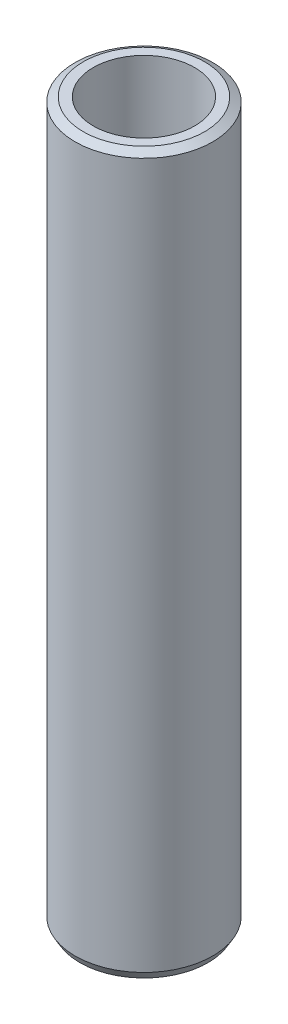
ISO-10303-21;
HEADER;
FILE_DESCRIPTION(('STEP AP214'),'2;1');
FILE_NAME('part.step','',(''),(''),'','','');
FILE_SCHEMA(('AUTOMOTIVE_DESIGN { 1 0 10303 214 1 1 1 1 }'));
ENDSEC;
DATA;
#1=APPLICATION_CONTEXT('core data for automotive mechanical design processes');
#2=APPLICATION_PROTOCOL_DEFINITION('international standard','automotive_design',2000,#1);
#3=PRODUCT_CONTEXT('',#1,'mechanical');
#4=PRODUCT('Part','Part','',(#3));
#5=PRODUCT_RELATED_PRODUCT_CATEGORY('part','',(#4));
#6=PRODUCT_DEFINITION_FORMATION('','',#4);
#7=PRODUCT_DEFINITION_CONTEXT('part definition',#1,'design');
#8=PRODUCT_DEFINITION('design','',#6,#7);
#9=PRODUCT_DEFINITION_SHAPE('','',#8);
#10=(LENGTH_UNIT() NAMED_UNIT(*) SI_UNIT(.MILLI.,.METRE.));
#11=(NAMED_UNIT(*) PLANE_ANGLE_UNIT() SI_UNIT($,.RADIAN.));
#12=(NAMED_UNIT(*) SI_UNIT($,.STERADIAN.) SOLID_ANGLE_UNIT());
#13=UNCERTAINTY_MEASURE_WITH_UNIT(LENGTH_MEASURE(1.E-05),#10,'distance_accuracy_value','');
#14=(GEOMETRIC_REPRESENTATION_CONTEXT(3) GLOBAL_UNCERTAINTY_ASSIGNED_CONTEXT((#13)) GLOBAL_UNIT_ASSIGNED_CONTEXT((#10,
#11,#12)) REPRESENTATION_CONTEXT('',''));
#15=CARTESIAN_POINT('',(0.,0.,0.));
#16=DIRECTION('',(0.,0.,1.));
#17=DIRECTION('',(1.,0.,0.));
#18=AXIS2_PLACEMENT_3D('',#15,#16,#17);
#19=CARTESIAN_POINT('',(0.,600.,0.));
#20=DIRECTION('',(0.,-1.,0.));
#21=DIRECTION('',(0.,0.,-1.));
#22=AXIS2_PLACEMENT_3D('',#19,#20,#21);
#23=CYLINDRICAL_SURFACE('',#22,57.5);
#24=CARTESIAN_POINT('',(0.,596.068807220003,0.));
#25=DIRECTION('',(0.,1.,0.));
#26=DIRECTION('',(0.,0.,1.));
#27=AXIS2_PLACEMENT_3D('',#24,#25,#26);
#28=CIRCLE('',#27,57.5);
#29=CARTESIAN_POINT('',(0.,596.068807220003,57.5));
#30=VERTEX_POINT('',#29);
#31=EDGE_CURVE('E50',#30,#30,#28,.F.);
#32=ORIENTED_EDGE('',*,*,#31,.T.);
#33=EDGE_LOOP('',(#32));
#34=FACE_BOUND('',#33,.T.);
#35=CARTESIAN_POINT('',(0.,6.80902562930219,0.));
#36=DIRECTION('',(0.,1.,0.));
#37=DIRECTION('',(0.,0.,1.));
#38=AXIS2_PLACEMENT_3D('',#35,#36,#37);
#39=CIRCLE('',#38,57.5);
#40=CARTESIAN_POINT('',(0.,6.80902562930219,57.5));
#41=VERTEX_POINT('',#40);
#42=EDGE_CURVE('E51',#41,#41,#39,.T.);
#43=ORIENTED_EDGE('',*,*,#42,.T.);
#44=EDGE_LOOP('',(#43));
#45=FACE_BOUND('',#44,.T.);
#46=ADVANCED_FACE('F39',(#34,#45),#23,.T.);
#47=CARTESIAN_POINT('',(0.,600.,0.));
#48=DIRECTION('',(0.,1.,0.));
#49=DIRECTION('',(0.,0.,1.));
#50=AXIS2_PLACEMENT_3D('',#47,#48,#49);
#51=PLANE('',#50);
#52=CARTESIAN_POINT('',(0.,600.,0.));
#53=DIRECTION('',(0.,1.,0.));
#54=DIRECTION('',(0.,0.,1.));
#55=AXIS2_PLACEMENT_3D('',#52,#53,#54);
#56=CIRCLE('',#55,50.6909743706976);
#57=CARTESIAN_POINT('',(0.,600.,50.6909743706976));
#58=VERTEX_POINT('',#57);
#59=EDGE_CURVE('E54',#58,#58,#56,.T.);
#60=ORIENTED_EDGE('',*,*,#59,.T.);
#61=EDGE_LOOP('',(#60));
#62=FACE_BOUND('',#61,.T.);
#63=CARTESIAN_POINT('',(0.,600.,0.));
#64=DIRECTION('',(0.,1.,0.));
#65=DIRECTION('',(0.,0.,1.));
#66=AXIS2_PLACEMENT_3D('',#63,#64,#65);
#67=CIRCLE('',#66,42.3572598121531);
#68=CARTESIAN_POINT('',(0.,600.,42.3572598121531));
#69=VERTEX_POINT('',#68);
#70=EDGE_CURVE('E58',#69,#69,#67,.T.);
#71=ORIENTED_EDGE('',*,*,#70,.F.);
#72=EDGE_LOOP('',(#71));
#73=FACE_BOUND('',#72,.T.);
#74=ADVANCED_FACE('F69',(#62,#73),#51,.T.);
#75=CARTESIAN_POINT('',(0.,0.,0.));
#76=DIRECTION('',(0.,1.,0.));
#77=DIRECTION('',(0.,0.,1.));
#78=AXIS2_PLACEMENT_3D('',#75,#76,#77);
#79=PLANE('',#78);
#80=CARTESIAN_POINT('',(0.,0.,0.));
#81=DIRECTION('',(0.,1.,0.));
#82=DIRECTION('',(0.,0.,1.));
#83=AXIS2_PLACEMENT_3D('',#80,#81,#82);
#84=CIRCLE('',#83,53.5688072200033);
#85=CARTESIAN_POINT('',(0.,0.,53.5688072200033));
#86=VERTEX_POINT('',#85);
#87=EDGE_CURVE('E10',#86,#86,#84,.F.);
#88=ORIENTED_EDGE('',*,*,#87,.T.);
#89=EDGE_LOOP('',(#88));
#90=FACE_BOUND('',#89,.T.);
#91=CARTESIAN_POINT('',(0.,0.,0.));
#92=DIRECTION('',(0.,1.,0.));
#93=DIRECTION('',(0.,0.,1.));
#94=AXIS2_PLACEMENT_3D('',#91,#92,#93);
#95=CIRCLE('',#94,42.3572598121531);
#96=CARTESIAN_POINT('',(0.,0.,42.3572598121531));
#97=VERTEX_POINT('',#96);
#98=EDGE_CURVE('E63',#97,#97,#95,.T.);
#99=ORIENTED_EDGE('',*,*,#98,.T.);
#100=EDGE_LOOP('',(#99));
#101=FACE_BOUND('',#100,.T.);
#102=ADVANCED_FACE('F75',(#90,#101),#79,.F.);
#103=CARTESIAN_POINT('',(0.,600.,0.));
#104=DIRECTION('',(0.,-1.,0.));
#105=DIRECTION('',(0.,0.,-1.));
#106=AXIS2_PLACEMENT_3D('',#103,#104,#105);
#107=CYLINDRICAL_SURFACE('',#106,42.3572598121531);
#108=ORIENTED_EDGE('',*,*,#70,.T.);
#109=EDGE_LOOP('',(#108));
#110=FACE_BOUND('',#109,.T.);
#111=ORIENTED_EDGE('',*,*,#98,.F.);
#112=EDGE_LOOP('',(#111));
#113=FACE_BOUND('',#112,.T.);
#114=ADVANCED_FACE('F70',(#110,#113),#107,.F.);
#115=CARTESIAN_POINT('',(0.,600.,0.));
#116=DIRECTION('',(0.,-1.,0.));
#117=DIRECTION('',(0.,0.,-1.));
#118=AXIS2_PLACEMENT_3D('',#115,#116,#117);
#119=CONICAL_SURFACE('',#118,50.6909743706976,1.04719755119659);
#120=ORIENTED_EDGE('',*,*,#31,.F.);
#121=EDGE_LOOP('',(#120));
#122=FACE_BOUND('',#121,.T.);
#123=ORIENTED_EDGE('',*,*,#59,.F.);
#124=EDGE_LOOP('',(#123));
#125=FACE_BOUND('',#124,.T.);
#126=ADVANCED_FACE('F81',(#122,#125),#119,.T.);
#127=CARTESIAN_POINT('',(0.,6.80902562930219,0.));
#128=DIRECTION('',(0.,1.,0.));
#129=DIRECTION('',(0.,0.,1.));
#130=AXIS2_PLACEMENT_3D('',#127,#128,#129);
#131=CONICAL_SURFACE('',#130,57.5,0.523598775598302);
#132=ORIENTED_EDGE('',*,*,#87,.F.);
#133=EDGE_LOOP('',(#132));
#134=FACE_BOUND('',#133,.T.);
#135=ORIENTED_EDGE('',*,*,#42,.F.);
#136=EDGE_LOOP('',(#135));
#137=FACE_BOUND('',#136,.T.);
#138=ADVANCED_FACE('F45',(#134,#137),#131,.T.);
#139=CLOSED_SHELL('',(#46,#74,#102,#114,#126,#138));
#140=MANIFOLD_SOLID_BREP('B2',#139);
#141=ADVANCED_BREP_SHAPE_REPRESENTATION('',(#18,#140),#14);
#142=SHAPE_DEFINITION_REPRESENTATION(#9,#141);
ENDSEC;
END-ISO-10303-21;
